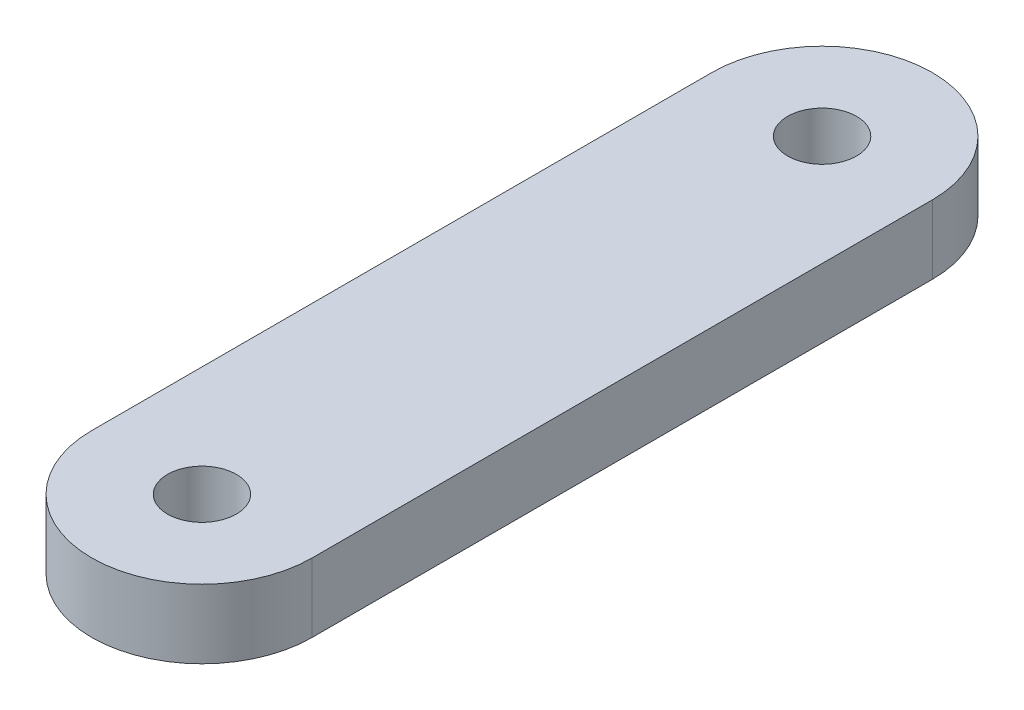
ISO-10303-21;
HEADER;
FILE_DESCRIPTION(('STEP AP214'),'2;1');
FILE_NAME('part.step','',(''),(''),'','','');
FILE_SCHEMA(('AUTOMOTIVE_DESIGN { 1 0 10303 214 1 1 1 1 }'));
ENDSEC;
DATA;
#1=APPLICATION_CONTEXT('core data for automotive mechanical design processes');
#2=APPLICATION_PROTOCOL_DEFINITION('international standard','automotive_design',2000,#1);
#3=PRODUCT_CONTEXT('',#1,'mechanical');
#4=PRODUCT('Part','Part','',(#3));
#5=PRODUCT_RELATED_PRODUCT_CATEGORY('part','',(#4));
#6=PRODUCT_DEFINITION_FORMATION('','',#4);
#7=PRODUCT_DEFINITION_CONTEXT('part definition',#1,'design');
#8=PRODUCT_DEFINITION('design','',#6,#7);
#9=PRODUCT_DEFINITION_SHAPE('','',#8);
#10=(LENGTH_UNIT() NAMED_UNIT(*) SI_UNIT(.MILLI.,.METRE.));
#11=(NAMED_UNIT(*) PLANE_ANGLE_UNIT() SI_UNIT($,.RADIAN.));
#12=(NAMED_UNIT(*) SI_UNIT($,.STERADIAN.) SOLID_ANGLE_UNIT());
#13=UNCERTAINTY_MEASURE_WITH_UNIT(LENGTH_MEASURE(1.E-05),#10,'distance_accuracy_value','');
#14=(GEOMETRIC_REPRESENTATION_CONTEXT(3) GLOBAL_UNCERTAINTY_ASSIGNED_CONTEXT((#13)) GLOBAL_UNIT_ASSIGNED_CONTEXT((#10,
#11,#12)) REPRESENTATION_CONTEXT('',''));
#15=CARTESIAN_POINT('',(0.,0.,0.));
#16=DIRECTION('',(0.,0.,1.));
#17=DIRECTION('',(1.,0.,0.));
#18=AXIS2_PLACEMENT_3D('',#15,#16,#17);
#19=CARTESIAN_POINT('',(0.,2.5,0.));
#20=DIRECTION('',(0.,1.,0.));
#21=DIRECTION('',(0.,0.,1.));
#22=AXIS2_PLACEMENT_3D('',#19,#20,#21);
#23=PLANE('',#22);
#24=CARTESIAN_POINT('',(0.,2.5,-22.5));
#25=DIRECTION('',(0.,1.,0.));
#26=DIRECTION('',(0.,0.,1.));
#27=AXIS2_PLACEMENT_3D('',#24,#25,#26);
#28=CIRCLE('',#27,1.25);
#29=CARTESIAN_POINT('',(0.,2.5,-21.25));
#30=VERTEX_POINT('',#29);
#31=EDGE_CURVE('E99',#30,#30,#28,.T.);
#32=ORIENTED_EDGE('',*,*,#31,.F.);
#33=EDGE_LOOP('',(#32));
#34=FACE_BOUND('',#33,.T.);
#35=CARTESIAN_POINT('',(0.,2.5,0.));
#36=DIRECTION('',(0.,1.,0.));
#37=DIRECTION('',(0.,0.,1.));
#38=AXIS2_PLACEMENT_3D('',#35,#36,#37);
#39=CIRCLE('',#38,4.);
#40=CARTESIAN_POINT('',(-4.,2.5,0.));
#41=VERTEX_POINT('',#40);
#42=CARTESIAN_POINT('',(4.,2.5,0.));
#43=VERTEX_POINT('',#42);
#44=EDGE_CURVE('E84',#41,#43,#39,.T.);
#45=ORIENTED_EDGE('',*,*,#44,.T.);
#46=DIRECTION('',(0.,0.,-1.));
#47=VECTOR('',#46,1.);
#48=CARTESIAN_POINT('',(4.,2.5,0.));
#49=LINE('',#48,#47);
#50=CARTESIAN_POINT('',(4.,2.5,-22.5));
#51=VERTEX_POINT('',#50);
#52=EDGE_CURVE('E79',#43,#51,#49,.T.);
#53=ORIENTED_EDGE('',*,*,#52,.T.);
#54=CARTESIAN_POINT('',(0.,2.5,-22.5));
#55=DIRECTION('',(0.,1.,0.));
#56=DIRECTION('',(0.,0.,1.));
#57=AXIS2_PLACEMENT_3D('',#54,#55,#56);
#58=CIRCLE('',#57,4.);
#59=CARTESIAN_POINT('',(-4.,2.5,-22.5));
#60=VERTEX_POINT('',#59);
#61=EDGE_CURVE('E82',#51,#60,#58,.T.);
#62=ORIENTED_EDGE('',*,*,#61,.T.);
#63=DIRECTION('',(0.,0.,1.));
#64=VECTOR('',#63,1.);
#65=CARTESIAN_POINT('',(-4.,2.5,0.));
#66=LINE('',#65,#64);
#67=EDGE_CURVE('E49',#60,#41,#66,.T.);
#68=ORIENTED_EDGE('',*,*,#67,.T.);
#69=EDGE_LOOP('',(#45,#53,#62,#68));
#70=FACE_BOUND('',#69,.T.);
#71=CARTESIAN_POINT('',(0.,2.5,0.));
#72=DIRECTION('',(0.,1.,0.));
#73=DIRECTION('',(0.,0.,1.));
#74=AXIS2_PLACEMENT_3D('',#71,#72,#73);
#75=CIRCLE('',#74,1.25);
#76=CARTESIAN_POINT('',(0.,2.5,1.25));
#77=VERTEX_POINT('',#76);
#78=EDGE_CURVE('E114',#77,#77,#75,.T.);
#79=ORIENTED_EDGE('',*,*,#78,.F.);
#80=EDGE_LOOP('',(#79));
#81=FACE_BOUND('',#80,.T.);
#82=ADVANCED_FACE('F32',(#34,#70,#81),#23,.T.);
#83=CARTESIAN_POINT('',(0.,0.,0.));
#84=DIRECTION('',(0.,1.,0.));
#85=DIRECTION('',(0.,0.,1.));
#86=AXIS2_PLACEMENT_3D('',#83,#84,#85);
#87=PLANE('',#86);
#88=CARTESIAN_POINT('',(0.,0.,0.));
#89=DIRECTION('',(0.,1.,0.));
#90=DIRECTION('',(0.,0.,1.));
#91=AXIS2_PLACEMENT_3D('',#88,#89,#90);
#92=CIRCLE('',#91,4.);
#93=CARTESIAN_POINT('',(-4.,0.,0.));
#94=VERTEX_POINT('',#93);
#95=CARTESIAN_POINT('',(4.,0.,0.));
#96=VERTEX_POINT('',#95);
#97=EDGE_CURVE('E96',#94,#96,#92,.T.);
#98=ORIENTED_EDGE('',*,*,#97,.F.);
#99=DIRECTION('',(0.,0.,1.));
#100=VECTOR('',#99,1.);
#101=CARTESIAN_POINT('',(-4.,0.,0.));
#102=LINE('',#101,#100);
#103=CARTESIAN_POINT('',(-4.,0.,-22.5));
#104=VERTEX_POINT('',#103);
#105=EDGE_CURVE('E72',#104,#94,#102,.T.);
#106=ORIENTED_EDGE('',*,*,#105,.F.);
#107=CARTESIAN_POINT('',(0.,0.,-22.5));
#108=DIRECTION('',(0.,1.,0.));
#109=DIRECTION('',(0.,0.,1.));
#110=AXIS2_PLACEMENT_3D('',#107,#108,#109);
#111=CIRCLE('',#110,4.);
#112=CARTESIAN_POINT('',(4.,0.,-22.5));
#113=VERTEX_POINT('',#112);
#114=EDGE_CURVE('E66',#113,#104,#111,.T.);
#115=ORIENTED_EDGE('',*,*,#114,.F.);
#116=DIRECTION('',(0.,0.,-1.));
#117=VECTOR('',#116,1.);
#118=CARTESIAN_POINT('',(4.,0.,0.));
#119=LINE('',#118,#117);
#120=EDGE_CURVE('E88',#96,#113,#119,.T.);
#121=ORIENTED_EDGE('',*,*,#120,.F.);
#122=EDGE_LOOP('',(#98,#106,#115,#121));
#123=FACE_BOUND('',#122,.T.);
#124=CARTESIAN_POINT('',(0.,0.,-22.5));
#125=DIRECTION('',(0.,1.,0.));
#126=DIRECTION('',(0.,0.,1.));
#127=AXIS2_PLACEMENT_3D('',#124,#125,#126);
#128=CIRCLE('',#127,1.25);
#129=CARTESIAN_POINT('',(0.,0.,-21.25));
#130=VERTEX_POINT('',#129);
#131=EDGE_CURVE('E111',#130,#130,#128,.T.);
#132=ORIENTED_EDGE('',*,*,#131,.T.);
#133=EDGE_LOOP('',(#132));
#134=FACE_BOUND('',#133,.T.);
#135=CARTESIAN_POINT('',(0.,0.,0.));
#136=DIRECTION('',(0.,1.,0.));
#137=DIRECTION('',(0.,0.,1.));
#138=AXIS2_PLACEMENT_3D('',#135,#136,#137);
#139=CIRCLE('',#138,1.25);
#140=CARTESIAN_POINT('',(0.,0.,1.25));
#141=VERTEX_POINT('',#140);
#142=EDGE_CURVE('E117',#141,#141,#139,.T.);
#143=ORIENTED_EDGE('',*,*,#142,.T.);
#144=EDGE_LOOP('',(#143));
#145=FACE_BOUND('',#144,.T.);
#146=ADVANCED_FACE('F107',(#123,#134,#145),#87,.F.);
#147=CARTESIAN_POINT('',(0.,2.5,0.));
#148=DIRECTION('',(0.,-1.,0.));
#149=DIRECTION('',(0.,0.,-1.));
#150=AXIS2_PLACEMENT_3D('',#147,#148,#149);
#151=CYLINDRICAL_SURFACE('',#150,4.);
#152=ORIENTED_EDGE('',*,*,#97,.T.);
#153=DIRECTION('',(0.,-1.,0.));
#154=VECTOR('',#153,1.);
#155=CARTESIAN_POINT('',(4.,2.5,0.));
#156=LINE('',#155,#154);
#157=EDGE_CURVE('E11',#43,#96,#156,.T.);
#158=ORIENTED_EDGE('',*,*,#157,.F.);
#159=ORIENTED_EDGE('',*,*,#44,.F.);
#160=DIRECTION('',(0.,-1.,0.));
#161=VECTOR('',#160,1.);
#162=CARTESIAN_POINT('',(-4.,2.5,0.));
#163=LINE('',#162,#161);
#164=EDGE_CURVE('E92',#41,#94,#163,.T.);
#165=ORIENTED_EDGE('',*,*,#164,.T.);
#166=EDGE_LOOP('',(#152,#158,#159,#165));
#167=FACE_BOUND('',#166,.T.);
#168=ADVANCED_FACE('F34',(#167),#151,.T.);
#169=CARTESIAN_POINT('',(4.,2.5,0.));
#170=DIRECTION('',(-1.,0.,0.));
#171=DIRECTION('',(0.,0.,1.));
#172=AXIS2_PLACEMENT_3D('',#169,#170,#171);
#173=PLANE('',#172);
#174=ORIENTED_EDGE('',*,*,#120,.T.);
#175=DIRECTION('',(0.,-1.,0.));
#176=VECTOR('',#175,1.);
#177=CARTESIAN_POINT('',(4.,2.5,-22.5));
#178=LINE('',#177,#176);
#179=EDGE_CURVE('E41',#51,#113,#178,.T.);
#180=ORIENTED_EDGE('',*,*,#179,.F.);
#181=ORIENTED_EDGE('',*,*,#52,.F.);
#182=ORIENTED_EDGE('',*,*,#157,.T.);
#183=EDGE_LOOP('',(#174,#180,#181,#182));
#184=FACE_BOUND('',#183,.T.);
#185=ADVANCED_FACE('F87',(#184),#173,.F.);
#186=CARTESIAN_POINT('',(0.,2.5,-22.5));
#187=DIRECTION('',(0.,-1.,0.));
#188=DIRECTION('',(0.,0.,-1.));
#189=AXIS2_PLACEMENT_3D('',#186,#187,#188);
#190=CYLINDRICAL_SURFACE('',#189,4.);
#191=ORIENTED_EDGE('',*,*,#114,.T.);
#192=DIRECTION('',(0.,-1.,0.));
#193=VECTOR('',#192,1.);
#194=CARTESIAN_POINT('',(-4.,2.5,-22.5));
#195=LINE('',#194,#193);
#196=EDGE_CURVE('E89',#60,#104,#195,.T.);
#197=ORIENTED_EDGE('',*,*,#196,.F.);
#198=ORIENTED_EDGE('',*,*,#61,.F.);
#199=ORIENTED_EDGE('',*,*,#179,.T.);
#200=EDGE_LOOP('',(#191,#197,#198,#199));
#201=FACE_BOUND('',#200,.T.);
#202=ADVANCED_FACE('F90',(#201),#190,.T.);
#203=CARTESIAN_POINT('',(-4.,2.5,0.));
#204=DIRECTION('',(1.,0.,0.));
#205=DIRECTION('',(0.,0.,-1.));
#206=AXIS2_PLACEMENT_3D('',#203,#204,#205);
#207=PLANE('',#206);
#208=ORIENTED_EDGE('',*,*,#105,.T.);
#209=ORIENTED_EDGE('',*,*,#164,.F.);
#210=ORIENTED_EDGE('',*,*,#67,.F.);
#211=ORIENTED_EDGE('',*,*,#196,.T.);
#212=EDGE_LOOP('',(#208,#209,#210,#211));
#213=FACE_BOUND('',#212,.T.);
#214=ADVANCED_FACE('F104',(#213),#207,.F.);
#215=CARTESIAN_POINT('',(0.,2.5,-22.5));
#216=DIRECTION('',(0.,-1.,0.));
#217=DIRECTION('',(0.,0.,-1.));
#218=AXIS2_PLACEMENT_3D('',#215,#216,#217);
#219=CYLINDRICAL_SURFACE('',#218,1.25);
#220=ORIENTED_EDGE('',*,*,#31,.T.);
#221=EDGE_LOOP('',(#220));
#222=FACE_BOUND('',#221,.T.);
#223=ORIENTED_EDGE('',*,*,#131,.F.);
#224=EDGE_LOOP('',(#223));
#225=FACE_BOUND('',#224,.T.);
#226=ADVANCED_FACE('F134',(#222,#225),#219,.F.);
#227=CARTESIAN_POINT('',(0.,2.5,0.));
#228=DIRECTION('',(0.,-1.,0.));
#229=DIRECTION('',(0.,0.,-1.));
#230=AXIS2_PLACEMENT_3D('',#227,#228,#229);
#231=CYLINDRICAL_SURFACE('',#230,1.25);
#232=ORIENTED_EDGE('',*,*,#78,.T.);
#233=EDGE_LOOP('',(#232));
#234=FACE_BOUND('',#233,.T.);
#235=ORIENTED_EDGE('',*,*,#142,.F.);
#236=EDGE_LOOP('',(#235));
#237=FACE_BOUND('',#236,.T.);
#238=ADVANCED_FACE('F123',(#234,#237),#231,.F.);
#239=CLOSED_SHELL('',(#82,#146,#168,#185,#202,#214,#226,#238));
#240=MANIFOLD_SOLID_BREP('B2',#239);
#241=ADVANCED_BREP_SHAPE_REPRESENTATION('',(#18,#240),#14);
#242=SHAPE_DEFINITION_REPRESENTATION(#9,#241);
ENDSEC;
END-ISO-10303-21;
